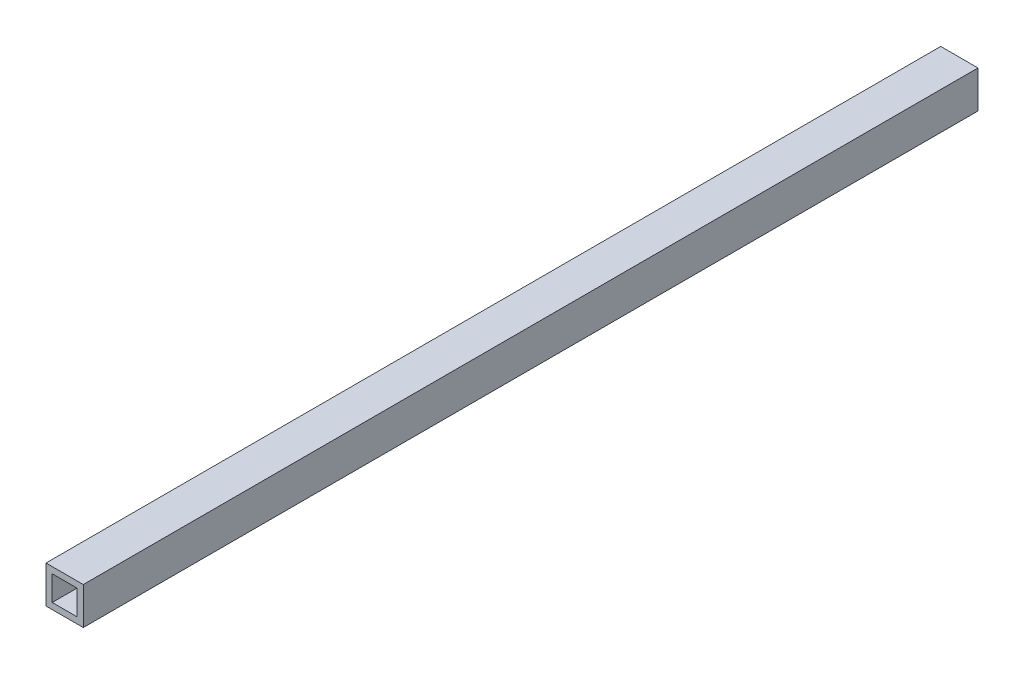
ISO-10303-21;
HEADER;
FILE_DESCRIPTION(('STEP AP214'),'2;1');
FILE_NAME('part.step','',(''),(''),'','','');
FILE_SCHEMA(('AUTOMOTIVE_DESIGN { 1 0 10303 214 1 1 1 1 }'));
ENDSEC;
DATA;
#1=APPLICATION_CONTEXT('core data for automotive mechanical design processes');
#2=APPLICATION_PROTOCOL_DEFINITION('international standard','automotive_design',2000,#1);
#3=PRODUCT_CONTEXT('',#1,'mechanical');
#4=PRODUCT('Part','Part','',(#3));
#5=PRODUCT_RELATED_PRODUCT_CATEGORY('part','',(#4));
#6=PRODUCT_DEFINITION_FORMATION('','',#4);
#7=PRODUCT_DEFINITION_CONTEXT('part definition',#1,'design');
#8=PRODUCT_DEFINITION('design','',#6,#7);
#9=PRODUCT_DEFINITION_SHAPE('','',#8);
#10=(LENGTH_UNIT() NAMED_UNIT(*) SI_UNIT(.MILLI.,.METRE.));
#11=(NAMED_UNIT(*) PLANE_ANGLE_UNIT() SI_UNIT($,.RADIAN.));
#12=(NAMED_UNIT(*) SI_UNIT($,.STERADIAN.) SOLID_ANGLE_UNIT());
#13=UNCERTAINTY_MEASURE_WITH_UNIT(LENGTH_MEASURE(1.E-05),#10,'distance_accuracy_value','');
#14=(GEOMETRIC_REPRESENTATION_CONTEXT(3) GLOBAL_UNCERTAINTY_ASSIGNED_CONTEXT((#13)) GLOBAL_UNIT_ASSIGNED_CONTEXT((#10,
#11,#12)) REPRESENTATION_CONTEXT('',''));
#15=CARTESIAN_POINT('',(0.,0.,0.));
#16=DIRECTION('',(0.,0.,1.));
#17=DIRECTION('',(1.,0.,0.));
#18=AXIS2_PLACEMENT_3D('',#15,#16,#17);
#19=CARTESIAN_POINT('',(9.52500000000001,-9.52499999999999,-457.2));
#20=DIRECTION('',(1.,0.,0.));
#21=DIRECTION('',(0.,0.,-1.));
#22=AXIS2_PLACEMENT_3D('',#19,#20,#21);
#23=PLANE('',#22);
#24=DIRECTION('',(0.,1.,0.));
#25=VECTOR('',#24,1.);
#26=CARTESIAN_POINT('',(9.52500000000001,-9.52499999999999,0.));
#27=LINE('',#26,#25);
#28=CARTESIAN_POINT('',(9.52500000000001,-9.52499999999999,0.));
#29=VERTEX_POINT('',#28);
#30=CARTESIAN_POINT('',(9.52500000000001,9.52500000000001,0.));
#31=VERTEX_POINT('',#30);
#32=EDGE_CURVE('E112',#29,#31,#27,.T.);
#33=ORIENTED_EDGE('',*,*,#32,.F.);
#34=DIRECTION('',(0.,0.,1.));
#35=VECTOR('',#34,1.);
#36=CARTESIAN_POINT('',(9.52500000000001,-9.52499999999999,-457.2));
#37=LINE('',#36,#35);
#38=CARTESIAN_POINT('',(9.52500000000001,-9.52499999999999,-457.2));
#39=VERTEX_POINT('',#38);
#40=EDGE_CURVE('E11',#39,#29,#37,.T.);
#41=ORIENTED_EDGE('',*,*,#40,.F.);
#42=DIRECTION('',(0.,1.,0.));
#43=VECTOR('',#42,1.);
#44=CARTESIAN_POINT('',(9.52500000000001,-9.52499999999999,-457.2));
#45=LINE('',#44,#43);
#46=CARTESIAN_POINT('',(9.52500000000001,9.52500000000001,-457.2));
#47=VERTEX_POINT('',#46);
#48=EDGE_CURVE('E151',#39,#47,#45,.T.);
#49=ORIENTED_EDGE('',*,*,#48,.T.);
#50=DIRECTION('',(0.,0.,1.));
#51=VECTOR('',#50,1.);
#52=CARTESIAN_POINT('',(9.52500000000001,9.52500000000001,-457.2));
#53=LINE('',#52,#51);
#54=EDGE_CURVE('E42',#47,#31,#53,.T.);
#55=ORIENTED_EDGE('',*,*,#54,.T.);
#56=EDGE_LOOP('',(#33,#41,#49,#55));
#57=FACE_BOUND('',#56,.T.);
#58=ADVANCED_FACE('F39',(#57),#23,.T.);
#59=CARTESIAN_POINT('',(-9.525,-9.52499999999999,-457.2));
#60=DIRECTION('',(0.,-1.,0.));
#61=DIRECTION('',(0.,0.,-1.));
#62=AXIS2_PLACEMENT_3D('',#59,#60,#61);
#63=PLANE('',#62);
#64=DIRECTION('',(1.,0.,0.));
#65=VECTOR('',#64,1.);
#66=CARTESIAN_POINT('',(-9.525,-9.52499999999999,0.));
#67=LINE('',#66,#65);
#68=CARTESIAN_POINT('',(-9.525,-9.52499999999999,0.));
#69=VERTEX_POINT('',#68);
#70=EDGE_CURVE('E156',#69,#29,#67,.T.);
#71=ORIENTED_EDGE('',*,*,#70,.F.);
#72=DIRECTION('',(0.,0.,1.));
#73=VECTOR('',#72,1.);
#74=CARTESIAN_POINT('',(-9.525,-9.52499999999999,-457.2));
#75=LINE('',#74,#73);
#76=CARTESIAN_POINT('',(-9.525,-9.52499999999999,-457.2));
#77=VERTEX_POINT('',#76);
#78=EDGE_CURVE('E48',#77,#69,#75,.T.);
#79=ORIENTED_EDGE('',*,*,#78,.F.);
#80=DIRECTION('',(1.,0.,0.));
#81=VECTOR('',#80,1.);
#82=CARTESIAN_POINT('',(-9.525,-9.52499999999999,-457.2));
#83=LINE('',#82,#81);
#84=EDGE_CURVE('E164',#77,#39,#83,.T.);
#85=ORIENTED_EDGE('',*,*,#84,.T.);
#86=ORIENTED_EDGE('',*,*,#40,.T.);
#87=EDGE_LOOP('',(#71,#79,#85,#86));
#88=FACE_BOUND('',#87,.T.);
#89=ADVANCED_FACE('F198',(#88),#63,.T.);
#90=CARTESIAN_POINT('',(-9.525,-9.52499999999999,-457.2));
#91=DIRECTION('',(-1.,0.,0.));
#92=DIRECTION('',(0.,0.,1.));
#93=AXIS2_PLACEMENT_3D('',#90,#91,#92);
#94=PLANE('',#93);
#95=DIRECTION('',(0.,-1.,0.));
#96=VECTOR('',#95,1.);
#97=CARTESIAN_POINT('',(-9.525,-9.52499999999999,0.));
#98=LINE('',#97,#96);
#99=CARTESIAN_POINT('',(-9.525,9.52500000000001,0.));
#100=VERTEX_POINT('',#99);
#101=EDGE_CURVE('E175',#100,#69,#98,.T.);
#102=ORIENTED_EDGE('',*,*,#101,.F.);
#103=DIRECTION('',(0.,0.,1.));
#104=VECTOR('',#103,1.);
#105=CARTESIAN_POINT('',(-9.525,9.52500000000001,-457.2));
#106=LINE('',#105,#104);
#107=CARTESIAN_POINT('',(-9.525,9.52500000000001,-457.2));
#108=VERTEX_POINT('',#107);
#109=EDGE_CURVE('E183',#108,#100,#106,.T.);
#110=ORIENTED_EDGE('',*,*,#109,.F.);
#111=DIRECTION('',(0.,-1.,0.));
#112=VECTOR('',#111,1.);
#113=CARTESIAN_POINT('',(-9.525,-9.52499999999999,-457.2));
#114=LINE('',#113,#112);
#115=EDGE_CURVE('E160',#108,#77,#114,.T.);
#116=ORIENTED_EDGE('',*,*,#115,.T.);
#117=ORIENTED_EDGE('',*,*,#78,.T.);
#118=EDGE_LOOP('',(#102,#110,#116,#117));
#119=FACE_BOUND('',#118,.T.);
#120=ADVANCED_FACE('F202',(#119),#94,.T.);
#121=CARTESIAN_POINT('',(-9.525,9.52500000000001,-457.2));
#122=DIRECTION('',(0.,1.,0.));
#123=DIRECTION('',(0.,0.,1.));
#124=AXIS2_PLACEMENT_3D('',#121,#122,#123);
#125=PLANE('',#124);
#126=DIRECTION('',(-1.,0.,0.));
#127=VECTOR('',#126,1.);
#128=CARTESIAN_POINT('',(-9.525,9.52500000000001,0.));
#129=LINE('',#128,#127);
#130=EDGE_CURVE('E171',#31,#100,#129,.T.);
#131=ORIENTED_EDGE('',*,*,#130,.F.);
#132=ORIENTED_EDGE('',*,*,#54,.F.);
#133=DIRECTION('',(-1.,0.,0.));
#134=VECTOR('',#133,1.);
#135=CARTESIAN_POINT('',(-9.525,9.52500000000001,-457.2));
#136=LINE('',#135,#134);
#137=EDGE_CURVE('E155',#47,#108,#136,.T.);
#138=ORIENTED_EDGE('',*,*,#137,.T.);
#139=ORIENTED_EDGE('',*,*,#109,.T.);
#140=EDGE_LOOP('',(#131,#132,#138,#139));
#141=FACE_BOUND('',#140,.T.);
#142=ADVANCED_FACE('F193',(#141),#125,.T.);
#143=CARTESIAN_POINT('',(0.,0.,-457.2));
#144=DIRECTION('',(0.,0.,-1.));
#145=DIRECTION('',(-1.,0.,0.));
#146=AXIS2_PLACEMENT_3D('',#143,#144,#145);
#147=PLANE('',#146);
#148=DIRECTION('',(0.,1.,0.));
#149=VECTOR('',#148,1.);
#150=CARTESIAN_POINT('',(6.35,-6.35,-457.2));
#151=LINE('',#150,#149);
#152=CARTESIAN_POINT('',(6.35,-6.35,-457.2));
#153=VERTEX_POINT('',#152);
#154=CARTESIAN_POINT('',(6.35,6.35,-457.2));
#155=VERTEX_POINT('',#154);
#156=EDGE_CURVE('E116',#153,#155,#151,.T.);
#157=ORIENTED_EDGE('',*,*,#156,.T.);
#158=DIRECTION('',(-1.,0.,0.));
#159=VECTOR('',#158,1.);
#160=CARTESIAN_POINT('',(-6.35,6.35,-457.2));
#161=LINE('',#160,#159);
#162=CARTESIAN_POINT('',(-6.35,6.35,-457.2));
#163=VERTEX_POINT('',#162);
#164=EDGE_CURVE('E104',#155,#163,#161,.T.);
#165=ORIENTED_EDGE('',*,*,#164,.T.);
#166=DIRECTION('',(0.,-1.,0.));
#167=VECTOR('',#166,1.);
#168=CARTESIAN_POINT('',(-6.35,-6.35,-457.2));
#169=LINE('',#168,#167);
#170=CARTESIAN_POINT('',(-6.35,-6.35,-457.2));
#171=VERTEX_POINT('',#170);
#172=EDGE_CURVE('E131',#163,#171,#169,.T.);
#173=ORIENTED_EDGE('',*,*,#172,.T.);
#174=DIRECTION('',(1.,0.,0.));
#175=VECTOR('',#174,1.);
#176=CARTESIAN_POINT('',(-6.35,-6.35,-457.2));
#177=LINE('',#176,#175);
#178=EDGE_CURVE('E124',#171,#153,#177,.T.);
#179=ORIENTED_EDGE('',*,*,#178,.T.);
#180=EDGE_LOOP('',(#157,#165,#173,#179));
#181=FACE_BOUND('',#180,.T.);
#182=ORIENTED_EDGE('',*,*,#48,.F.);
#183=ORIENTED_EDGE('',*,*,#84,.F.);
#184=ORIENTED_EDGE('',*,*,#115,.F.);
#185=ORIENTED_EDGE('',*,*,#137,.F.);
#186=EDGE_LOOP('',(#182,#183,#184,#185));
#187=FACE_BOUND('',#186,.T.);
#188=ADVANCED_FACE('F122',(#181,#187),#147,.T.);
#189=CARTESIAN_POINT('',(0.,0.,0.));
#190=DIRECTION('',(0.,0.,-1.));
#191=DIRECTION('',(-1.,0.,0.));
#192=AXIS2_PLACEMENT_3D('',#189,#190,#191);
#193=PLANE('',#192);
#194=DIRECTION('',(-1.,0.,0.));
#195=VECTOR('',#194,1.);
#196=CARTESIAN_POINT('',(-6.35,6.35,0.));
#197=LINE('',#196,#195);
#198=CARTESIAN_POINT('',(6.35,6.35,0.));
#199=VERTEX_POINT('',#198);
#200=CARTESIAN_POINT('',(-6.35,6.35,0.));
#201=VERTEX_POINT('',#200);
#202=EDGE_CURVE('E129',#199,#201,#197,.T.);
#203=ORIENTED_EDGE('',*,*,#202,.F.);
#204=DIRECTION('',(0.,1.,0.));
#205=VECTOR('',#204,1.);
#206=CARTESIAN_POINT('',(6.35,-6.35,0.));
#207=LINE('',#206,#205);
#208=CARTESIAN_POINT('',(6.35,-6.35,0.));
#209=VERTEX_POINT('',#208);
#210=EDGE_CURVE('E64',#209,#199,#207,.T.);
#211=ORIENTED_EDGE('',*,*,#210,.F.);
#212=DIRECTION('',(1.,0.,0.));
#213=VECTOR('',#212,1.);
#214=CARTESIAN_POINT('',(-6.35,-6.35,0.));
#215=LINE('',#214,#213);
#216=CARTESIAN_POINT('',(-6.35,-6.35,0.));
#217=VERTEX_POINT('',#216);
#218=EDGE_CURVE('E119',#217,#209,#215,.T.);
#219=ORIENTED_EDGE('',*,*,#218,.F.);
#220=DIRECTION('',(0.,-1.,0.));
#221=VECTOR('',#220,1.);
#222=CARTESIAN_POINT('',(-6.35,-6.35,0.));
#223=LINE('',#222,#221);
#224=EDGE_CURVE('E137',#201,#217,#223,.T.);
#225=ORIENTED_EDGE('',*,*,#224,.F.);
#226=EDGE_LOOP('',(#203,#211,#219,#225));
#227=FACE_BOUND('',#226,.T.);
#228=ORIENTED_EDGE('',*,*,#32,.T.);
#229=ORIENTED_EDGE('',*,*,#130,.T.);
#230=ORIENTED_EDGE('',*,*,#101,.T.);
#231=ORIENTED_EDGE('',*,*,#70,.T.);
#232=EDGE_LOOP('',(#228,#229,#230,#231));
#233=FACE_BOUND('',#232,.T.);
#234=ADVANCED_FACE('F195',(#227,#233),#193,.F.);
#235=CARTESIAN_POINT('',(6.35,-6.35,-457.201));
#236=DIRECTION('',(1.,0.,0.));
#237=DIRECTION('',(0.,0.,-1.));
#238=AXIS2_PLACEMENT_3D('',#235,#236,#237);
#239=PLANE('',#238);
#240=DIRECTION('',(0.,0.,1.));
#241=VECTOR('',#240,1.);
#242=CARTESIAN_POINT('',(6.35,-6.35,-457.201));
#243=LINE('',#242,#241);
#244=EDGE_CURVE('E113',#153,#209,#243,.T.);
#245=ORIENTED_EDGE('',*,*,#244,.T.);
#246=ORIENTED_EDGE('',*,*,#210,.T.);
#247=DIRECTION('',(0.,0.,1.));
#248=VECTOR('',#247,1.);
#249=CARTESIAN_POINT('',(6.35,6.35,-457.201));
#250=LINE('',#249,#248);
#251=EDGE_CURVE('E106',#155,#199,#250,.T.);
#252=ORIENTED_EDGE('',*,*,#251,.F.);
#253=ORIENTED_EDGE('',*,*,#156,.F.);
#254=EDGE_LOOP('',(#245,#246,#252,#253));
#255=FACE_BOUND('',#254,.T.);
#256=ADVANCED_FACE('F115',(#255),#239,.F.);
#257=CARTESIAN_POINT('',(-6.35,-6.35,-457.201));
#258=DIRECTION('',(0.,-1.,0.));
#259=DIRECTION('',(0.,0.,-1.));
#260=AXIS2_PLACEMENT_3D('',#257,#258,#259);
#261=PLANE('',#260);
#262=DIRECTION('',(0.,0.,1.));
#263=VECTOR('',#262,1.);
#264=CARTESIAN_POINT('',(-6.35,-6.35,-457.201));
#265=LINE('',#264,#263);
#266=EDGE_CURVE('E146',#171,#217,#265,.T.);
#267=ORIENTED_EDGE('',*,*,#266,.T.);
#268=ORIENTED_EDGE('',*,*,#218,.T.);
#269=ORIENTED_EDGE('',*,*,#244,.F.);
#270=ORIENTED_EDGE('',*,*,#178,.F.);
#271=EDGE_LOOP('',(#267,#268,#269,#270));
#272=FACE_BOUND('',#271,.T.);
#273=ADVANCED_FACE('F253',(#272),#261,.F.);
#274=CARTESIAN_POINT('',(-6.35,-6.35,-457.201));
#275=DIRECTION('',(-1.,0.,0.));
#276=DIRECTION('',(0.,0.,1.));
#277=AXIS2_PLACEMENT_3D('',#274,#275,#276);
#278=PLANE('',#277);
#279=DIRECTION('',(0.,0.,1.));
#280=VECTOR('',#279,1.);
#281=CARTESIAN_POINT('',(-6.35,6.35,-457.201));
#282=LINE('',#281,#280);
#283=EDGE_CURVE('E56',#163,#201,#282,.T.);
#284=ORIENTED_EDGE('',*,*,#283,.T.);
#285=ORIENTED_EDGE('',*,*,#224,.T.);
#286=ORIENTED_EDGE('',*,*,#266,.F.);
#287=ORIENTED_EDGE('',*,*,#172,.F.);
#288=EDGE_LOOP('',(#284,#285,#286,#287));
#289=FACE_BOUND('',#288,.T.);
#290=ADVANCED_FACE('F262',(#289),#278,.F.);
#291=CARTESIAN_POINT('',(-6.35,6.35,-457.201));
#292=DIRECTION('',(0.,1.,0.));
#293=DIRECTION('',(0.,0.,1.));
#294=AXIS2_PLACEMENT_3D('',#291,#292,#293);
#295=PLANE('',#294);
#296=ORIENTED_EDGE('',*,*,#251,.T.);
#297=ORIENTED_EDGE('',*,*,#202,.T.);
#298=ORIENTED_EDGE('',*,*,#283,.F.);
#299=ORIENTED_EDGE('',*,*,#164,.F.);
#300=EDGE_LOOP('',(#296,#297,#298,#299));
#301=FACE_BOUND('',#300,.T.);
#302=ADVANCED_FACE('F105',(#301),#295,.F.);
#303=CLOSED_SHELL('',(#58,#89,#120,#142,#188,#234,#256,#273,#290,#302));
#304=MANIFOLD_SOLID_BREP('B2',#303);
#305=ADVANCED_BREP_SHAPE_REPRESENTATION('',(#18,#304),#14);
#306=SHAPE_DEFINITION_REPRESENTATION(#9,#305);
ENDSEC;
END-ISO-10303-21;
